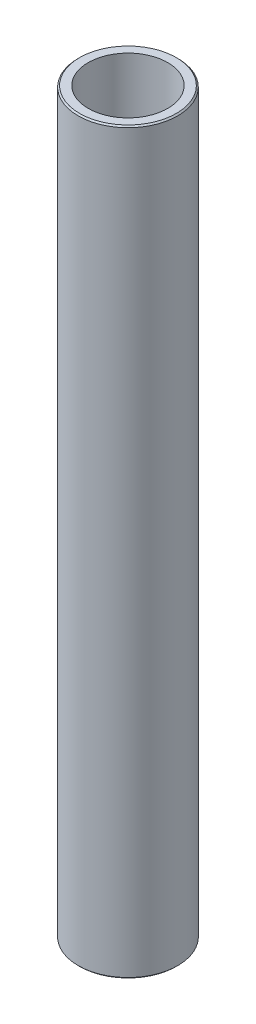
ISO-10303-21;
HEADER;
FILE_DESCRIPTION(('STEP AP214'),'2;1');
FILE_NAME('part.step','',(''),(''),'','','');
FILE_SCHEMA(('AUTOMOTIVE_DESIGN { 1 0 10303 214 1 1 1 1 }'));
ENDSEC;
DATA;
#1=APPLICATION_CONTEXT('core data for automotive mechanical design processes');
#2=APPLICATION_PROTOCOL_DEFINITION('international standard','automotive_design',2000,#1);
#3=PRODUCT_CONTEXT('',#1,'mechanical');
#4=PRODUCT('Part','Part','',(#3));
#5=PRODUCT_RELATED_PRODUCT_CATEGORY('part','',(#4));
#6=PRODUCT_DEFINITION_FORMATION('','',#4);
#7=PRODUCT_DEFINITION_CONTEXT('part definition',#1,'design');
#8=PRODUCT_DEFINITION('design','',#6,#7);
#9=PRODUCT_DEFINITION_SHAPE('','',#8);
#10=(LENGTH_UNIT() NAMED_UNIT(*) SI_UNIT(.MILLI.,.METRE.));
#11=(NAMED_UNIT(*) PLANE_ANGLE_UNIT() SI_UNIT($,.RADIAN.));
#12=(NAMED_UNIT(*) SI_UNIT($,.STERADIAN.) SOLID_ANGLE_UNIT());
#13=UNCERTAINTY_MEASURE_WITH_UNIT(LENGTH_MEASURE(1.E-05),#10,'distance_accuracy_value','');
#14=(GEOMETRIC_REPRESENTATION_CONTEXT(3) GLOBAL_UNCERTAINTY_ASSIGNED_CONTEXT((#13)) GLOBAL_UNIT_ASSIGNED_CONTEXT((#10,
#11,#12)) REPRESENTATION_CONTEXT('',''));
#15=CARTESIAN_POINT('',(0.,0.,0.));
#16=DIRECTION('',(0.,0.,1.));
#17=DIRECTION('',(1.,0.,0.));
#18=AXIS2_PLACEMENT_3D('',#15,#16,#17);
#19=CARTESIAN_POINT('',(0.,593.670966847411,0.));
#20=DIRECTION('',(0.,-1.,0.));
#21=DIRECTION('',(0.,0.,-1.));
#22=AXIS2_PLACEMENT_3D('',#19,#20,#21);
#23=CYLINDRICAL_SURFACE('',#22,40.);
#24=CARTESIAN_POINT('',(0.,592.554708239395,0.));
#25=DIRECTION('',(0.,1.,0.));
#26=DIRECTION('',(0.,0.,1.));
#27=AXIS2_PLACEMENT_3D('',#24,#25,#26);
#28=CIRCLE('',#27,40.);
#29=CARTESIAN_POINT('',(0.,592.554708239395,40.));
#30=VERTEX_POINT('',#29);
#31=EDGE_CURVE('E50',#30,#30,#28,.F.);
#32=ORIENTED_EDGE('',*,*,#31,.T.);
#33=EDGE_LOOP('',(#32));
#34=FACE_BOUND('',#33,.T.);
#35=CARTESIAN_POINT('',(0.,1.11625860801634,0.));
#36=DIRECTION('',(0.,1.,0.));
#37=DIRECTION('',(0.,0.,1.));
#38=AXIS2_PLACEMENT_3D('',#35,#36,#37);
#39=CIRCLE('',#38,40.);
#40=CARTESIAN_POINT('',(0.,1.11625860801634,40.));
#41=VERTEX_POINT('',#40);
#42=EDGE_CURVE('E51',#41,#41,#39,.T.);
#43=ORIENTED_EDGE('',*,*,#42,.T.);
#44=EDGE_LOOP('',(#43));
#45=FACE_BOUND('',#44,.T.);
#46=ADVANCED_FACE('F39',(#34,#45),#23,.T.);
#47=CARTESIAN_POINT('',(0.,593.670966847411,0.));
#48=DIRECTION('',(0.,1.,0.));
#49=DIRECTION('',(0.,0.,1.));
#50=AXIS2_PLACEMENT_3D('',#47,#48,#49);
#51=PLANE('',#50);
#52=CARTESIAN_POINT('',(0.,593.670966847411,0.));
#53=DIRECTION('',(0.,1.,0.));
#54=DIRECTION('',(0.,0.,1.));
#55=AXIS2_PLACEMENT_3D('',#52,#53,#54);
#56=CIRCLE('',#55,38.8837413919836);
#57=CARTESIAN_POINT('',(0.,593.670966847411,38.8837413919836));
#58=VERTEX_POINT('',#57);
#59=EDGE_CURVE('E54',#58,#58,#56,.T.);
#60=ORIENTED_EDGE('',*,*,#59,.T.);
#61=EDGE_LOOP('',(#60));
#62=FACE_BOUND('',#61,.T.);
#63=CARTESIAN_POINT('',(0.,593.670966847411,0.));
#64=DIRECTION('',(0.,1.,0.));
#65=DIRECTION('',(0.,0.,1.));
#66=AXIS2_PLACEMENT_3D('',#63,#64,#65);
#67=CIRCLE('',#66,31.9475748580545);
#68=CARTESIAN_POINT('',(0.,593.670966847411,31.9475748580545));
#69=VERTEX_POINT('',#68);
#70=EDGE_CURVE('E58',#69,#69,#67,.T.);
#71=ORIENTED_EDGE('',*,*,#70,.F.);
#72=EDGE_LOOP('',(#71));
#73=FACE_BOUND('',#72,.T.);
#74=ADVANCED_FACE('F69',(#62,#73),#51,.T.);
#75=CARTESIAN_POINT('',(0.,0.,0.));
#76=DIRECTION('',(0.,1.,0.));
#77=DIRECTION('',(0.,0.,1.));
#78=AXIS2_PLACEMENT_3D('',#75,#76,#77);
#79=PLANE('',#78);
#80=CARTESIAN_POINT('',(0.,0.,0.));
#81=DIRECTION('',(0.,1.,0.));
#82=DIRECTION('',(0.,0.,1.));
#83=AXIS2_PLACEMENT_3D('',#80,#81,#82);
#84=CIRCLE('',#83,38.8837413919836);
#85=CARTESIAN_POINT('',(0.,0.,38.8837413919836));
#86=VERTEX_POINT('',#85);
#87=EDGE_CURVE('E10',#86,#86,#84,.F.);
#88=ORIENTED_EDGE('',*,*,#87,.T.);
#89=EDGE_LOOP('',(#88));
#90=FACE_BOUND('',#89,.T.);
#91=CARTESIAN_POINT('',(0.,0.,0.));
#92=DIRECTION('',(0.,1.,0.));
#93=DIRECTION('',(0.,0.,1.));
#94=AXIS2_PLACEMENT_3D('',#91,#92,#93);
#95=CIRCLE('',#94,31.9475748580545);
#96=CARTESIAN_POINT('',(0.,0.,31.9475748580545));
#97=VERTEX_POINT('',#96);
#98=EDGE_CURVE('E63',#97,#97,#95,.T.);
#99=ORIENTED_EDGE('',*,*,#98,.T.);
#100=EDGE_LOOP('',(#99));
#101=FACE_BOUND('',#100,.T.);
#102=ADVANCED_FACE('F75',(#90,#101),#79,.F.);
#103=CARTESIAN_POINT('',(0.,593.670966847411,0.));
#104=DIRECTION('',(0.,-1.,0.));
#105=DIRECTION('',(0.,0.,-1.));
#106=AXIS2_PLACEMENT_3D('',#103,#104,#105);
#107=CYLINDRICAL_SURFACE('',#106,31.9475748580545);
#108=ORIENTED_EDGE('',*,*,#70,.T.);
#109=EDGE_LOOP('',(#108));
#110=FACE_BOUND('',#109,.T.);
#111=ORIENTED_EDGE('',*,*,#98,.F.);
#112=EDGE_LOOP('',(#111));
#113=FACE_BOUND('',#112,.T.);
#114=ADVANCED_FACE('F70',(#110,#113),#107,.F.);
#115=CARTESIAN_POINT('',(0.,593.670966847411,0.));
#116=DIRECTION('',(0.,-1.,0.));
#117=DIRECTION('',(0.,0.,-1.));
#118=AXIS2_PLACEMENT_3D('',#115,#116,#117);
#119=CONICAL_SURFACE('',#118,38.8837413919836,0.785398163397458);
#120=ORIENTED_EDGE('',*,*,#31,.F.);
#121=EDGE_LOOP('',(#120));
#122=FACE_BOUND('',#121,.T.);
#123=ORIENTED_EDGE('',*,*,#59,.F.);
#124=EDGE_LOOP('',(#123));
#125=FACE_BOUND('',#124,.T.);
#126=ADVANCED_FACE('F81',(#122,#125),#119,.T.);
#127=CARTESIAN_POINT('',(0.,1.11625860801634,0.));
#128=DIRECTION('',(0.,1.,0.));
#129=DIRECTION('',(0.,0.,1.));
#130=AXIS2_PLACEMENT_3D('',#127,#128,#129);
#131=CONICAL_SURFACE('',#130,40.,0.785398163397458);
#132=ORIENTED_EDGE('',*,*,#87,.F.);
#133=EDGE_LOOP('',(#132));
#134=FACE_BOUND('',#133,.T.);
#135=ORIENTED_EDGE('',*,*,#42,.F.);
#136=EDGE_LOOP('',(#135));
#137=FACE_BOUND('',#136,.T.);
#138=ADVANCED_FACE('F45',(#134,#137),#131,.T.);
#139=CLOSED_SHELL('',(#46,#74,#102,#114,#126,#138));
#140=MANIFOLD_SOLID_BREP('B2',#139);
#141=ADVANCED_BREP_SHAPE_REPRESENTATION('',(#18,#140),#14);
#142=SHAPE_DEFINITION_REPRESENTATION(#9,#141);
ENDSEC;
END-ISO-10303-21;
